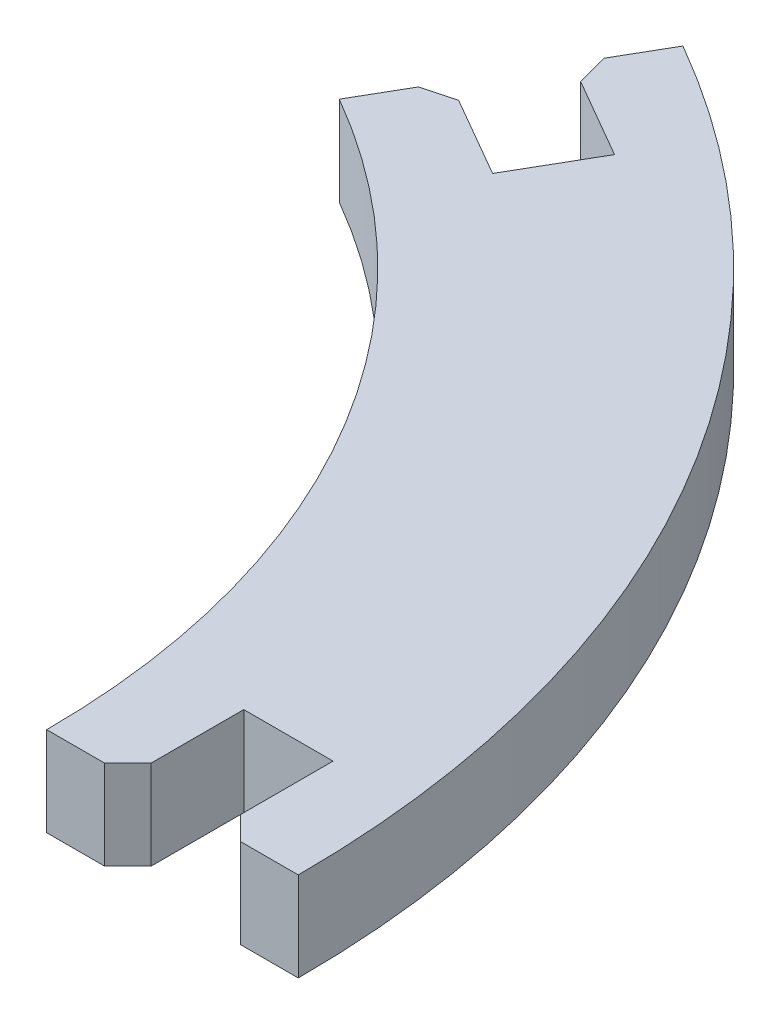
ISO-10303-21;
HEADER;
FILE_DESCRIPTION(('STEP AP214'),'2;1');
FILE_NAME('part.step','',(''),(''),'','','');
FILE_SCHEMA(('AUTOMOTIVE_DESIGN { 1 0 10303 214 1 1 1 1 }'));
ENDSEC;
DATA;
#1=APPLICATION_CONTEXT('core data for automotive mechanical design processes');
#2=APPLICATION_PROTOCOL_DEFINITION('international standard','automotive_design',2000,#1);
#3=PRODUCT_CONTEXT('',#1,'mechanical');
#4=PRODUCT('Part','Part','',(#3));
#5=PRODUCT_RELATED_PRODUCT_CATEGORY('part','',(#4));
#6=PRODUCT_DEFINITION_FORMATION('','',#4);
#7=PRODUCT_DEFINITION_CONTEXT('part definition',#1,'design');
#8=PRODUCT_DEFINITION('design','',#6,#7);
#9=PRODUCT_DEFINITION_SHAPE('','',#8);
#10=(LENGTH_UNIT() NAMED_UNIT(*) SI_UNIT(.MILLI.,.METRE.));
#11=(NAMED_UNIT(*) PLANE_ANGLE_UNIT() SI_UNIT($,.RADIAN.));
#12=(NAMED_UNIT(*) SI_UNIT($,.STERADIAN.) SOLID_ANGLE_UNIT());
#13=UNCERTAINTY_MEASURE_WITH_UNIT(LENGTH_MEASURE(1.E-05),#10,'distance_accuracy_value','');
#14=(GEOMETRIC_REPRESENTATION_CONTEXT(3) GLOBAL_UNCERTAINTY_ASSIGNED_CONTEXT((#13)) GLOBAL_UNIT_ASSIGNED_CONTEXT((#10,
#11,#12)) REPRESENTATION_CONTEXT('',''));
#15=CARTESIAN_POINT('',(0.,0.,0.));
#16=DIRECTION('',(0.,0.,1.));
#17=DIRECTION('',(1.,0.,0.));
#18=AXIS2_PLACEMENT_3D('',#15,#16,#17);
#19=CARTESIAN_POINT('',(34.475,3.85,0.));
#20=DIRECTION('',(0.,0.,-1.));
#21=DIRECTION('',(-1.,0.,0.));
#22=AXIS2_PLACEMENT_3D('',#19,#20,#21);
#23=PLANE('',#22);
#24=DIRECTION('',(1.,0.,0.));
#25=VECTOR('',#24,1.);
#26=CARTESIAN_POINT('',(34.475,0.,0.));
#27=LINE('',#26,#25);
#28=CARTESIAN_POINT('',(34.475,0.,0.));
#29=VERTEX_POINT('',#28);
#30=CARTESIAN_POINT('',(36.975,0.,0.));
#31=VERTEX_POINT('',#30);
#32=EDGE_CURVE('E199',#29,#31,#27,.T.);
#33=ORIENTED_EDGE('',*,*,#32,.T.);
#34=DIRECTION('',(0.,1.,0.));
#35=VECTOR('',#34,1.);
#36=CARTESIAN_POINT('',(36.975,3.85,0.));
#37=LINE('',#36,#35);
#38=CARTESIAN_POINT('',(36.975,3.85,0.));
#39=VERTEX_POINT('',#38);
#40=EDGE_CURVE('E264',#31,#39,#37,.T.);
#41=ORIENTED_EDGE('',*,*,#40,.T.);
#42=DIRECTION('',(1.,0.,0.));
#43=VECTOR('',#42,1.);
#44=CARTESIAN_POINT('',(34.475,3.85,0.));
#45=LINE('',#44,#43);
#46=CARTESIAN_POINT('',(34.475,3.85,0.));
#47=VERTEX_POINT('',#46);
#48=EDGE_CURVE('E158',#47,#39,#45,.T.);
#49=ORIENTED_EDGE('',*,*,#48,.F.);
#50=DIRECTION('',(0.,-1.,0.));
#51=VECTOR('',#50,1.);
#52=CARTESIAN_POINT('',(34.475,3.85,0.));
#53=LINE('',#52,#51);
#54=EDGE_CURVE('E198',#47,#29,#53,.T.);
#55=ORIENTED_EDGE('',*,*,#54,.T.);
#56=EDGE_LOOP('',(#33,#41,#49,#55));
#57=FACE_BOUND('',#56,.T.);
#58=ADVANCED_FACE('F33',(#57),#23,.F.);
#59=CARTESIAN_POINT('',(37.975,3.85,0.));
#60=DIRECTION('',(-1.,0.,0.));
#61=DIRECTION('',(0.,0.,1.));
#62=AXIS2_PLACEMENT_3D('',#59,#60,#61);
#63=PLANE('',#62);
#64=DIRECTION('',(0.,0.,-1.));
#65=VECTOR('',#64,1.);
#66=CARTESIAN_POINT('',(37.975,3.85,0.));
#67=LINE('',#66,#65);
#68=CARTESIAN_POINT('',(37.975,3.85,-1.00000000000002));
#69=VERTEX_POINT('',#68);
#70=CARTESIAN_POINT('',(37.975,3.85,-5.00000000000002));
#71=VERTEX_POINT('',#70);
#72=EDGE_CURVE('E145',#69,#71,#67,.T.);
#73=ORIENTED_EDGE('',*,*,#72,.F.);
#74=DIRECTION('',(0.,-1.,0.));
#75=VECTOR('',#74,1.);
#76=CARTESIAN_POINT('',(37.975,3.85,-1.00000000000002));
#77=LINE('',#76,#75);
#78=CARTESIAN_POINT('',(37.975,0.,-1.00000000000002));
#79=VERTEX_POINT('',#78);
#80=EDGE_CURVE('E262',#69,#79,#77,.T.);
#81=ORIENTED_EDGE('',*,*,#80,.T.);
#82=DIRECTION('',(0.,0.,-1.));
#83=VECTOR('',#82,1.);
#84=CARTESIAN_POINT('',(37.975,0.,0.));
#85=LINE('',#84,#83);
#86=CARTESIAN_POINT('',(37.975,0.,-5.00000000000002));
#87=VERTEX_POINT('',#86);
#88=EDGE_CURVE('E164',#79,#87,#85,.T.);
#89=ORIENTED_EDGE('',*,*,#88,.T.);
#90=DIRECTION('',(0.,-1.,0.));
#91=VECTOR('',#90,1.);
#92=CARTESIAN_POINT('',(37.975,3.85,-5.00000000000002));
#93=LINE('',#92,#91);
#94=EDGE_CURVE('E161',#71,#87,#93,.T.);
#95=ORIENTED_EDGE('',*,*,#94,.F.);
#96=EDGE_LOOP('',(#73,#81,#89,#95));
#97=FACE_BOUND('',#96,.T.);
#98=ADVANCED_FACE('F162',(#97),#63,.F.);
#99=CARTESIAN_POINT('',(37.975,3.85,-5.00000000000002));
#100=DIRECTION('',(0.,0.,-1.));
#101=DIRECTION('',(-1.,0.,0.));
#102=AXIS2_PLACEMENT_3D('',#99,#100,#101);
#103=PLANE('',#102);
#104=DIRECTION('',(1.,0.,0.));
#105=VECTOR('',#104,1.);
#106=CARTESIAN_POINT('',(37.975,0.,-5.00000000000002));
#107=LINE('',#106,#105);
#108=CARTESIAN_POINT('',(41.825,0.,-5.00000000000002));
#109=VERTEX_POINT('',#108);
#110=EDGE_CURVE('E203',#87,#109,#107,.T.);
#111=ORIENTED_EDGE('',*,*,#110,.T.);
#112=DIRECTION('',(0.,-1.,0.));
#113=VECTOR('',#112,1.);
#114=CARTESIAN_POINT('',(41.825,3.85,-5.00000000000002));
#115=LINE('',#114,#113);
#116=CARTESIAN_POINT('',(41.825,3.85,-5.00000000000002));
#117=VERTEX_POINT('',#116);
#118=EDGE_CURVE('E168',#117,#109,#115,.T.);
#119=ORIENTED_EDGE('',*,*,#118,.F.);
#120=DIRECTION('',(1.,0.,0.));
#121=VECTOR('',#120,1.);
#122=CARTESIAN_POINT('',(37.975,3.85,-5.00000000000002));
#123=LINE('',#122,#121);
#124=EDGE_CURVE('E150',#71,#117,#123,.T.);
#125=ORIENTED_EDGE('',*,*,#124,.F.);
#126=ORIENTED_EDGE('',*,*,#94,.T.);
#127=EDGE_LOOP('',(#111,#119,#125,#126));
#128=FACE_BOUND('',#127,.T.);
#129=ADVANCED_FACE('F170',(#128),#103,.F.);
#130=CARTESIAN_POINT('',(41.825,3.85,-5.00000000000002));
#131=DIRECTION('',(1.,0.,0.));
#132=DIRECTION('',(0.,0.,-1.));
#133=AXIS2_PLACEMENT_3D('',#130,#131,#132);
#134=PLANE('',#133);
#135=DIRECTION('',(0.,0.,1.));
#136=VECTOR('',#135,1.);
#137=CARTESIAN_POINT('',(41.825,0.,-5.00000000000002));
#138=LINE('',#137,#136);
#139=CARTESIAN_POINT('',(41.825,0.,-1.00000000000002));
#140=VERTEX_POINT('',#139);
#141=EDGE_CURVE('E205',#109,#140,#138,.T.);
#142=ORIENTED_EDGE('',*,*,#141,.T.);
#143=DIRECTION('',(0.,1.,0.));
#144=VECTOR('',#143,1.);
#145=CARTESIAN_POINT('',(41.825,3.85,-1.00000000000002));
#146=LINE('',#145,#144);
#147=CARTESIAN_POINT('',(41.825,3.85,-1.00000000000002));
#148=VERTEX_POINT('',#147);
#149=EDGE_CURVE('E254',#140,#148,#146,.T.);
#150=ORIENTED_EDGE('',*,*,#149,.T.);
#151=DIRECTION('',(0.,0.,1.));
#152=VECTOR('',#151,1.);
#153=CARTESIAN_POINT('',(41.825,3.85,-5.00000000000002));
#154=LINE('',#153,#152);
#155=EDGE_CURVE('E173',#117,#148,#154,.T.);
#156=ORIENTED_EDGE('',*,*,#155,.F.);
#157=ORIENTED_EDGE('',*,*,#118,.T.);
#158=EDGE_LOOP('',(#142,#150,#156,#157));
#159=FACE_BOUND('',#158,.T.);
#160=ADVANCED_FACE('F306',(#159),#134,.F.);
#161=CARTESIAN_POINT('',(41.825,3.85,0.));
#162=DIRECTION('',(0.,0.,-1.));
#163=DIRECTION('',(-1.,0.,0.));
#164=AXIS2_PLACEMENT_3D('',#161,#162,#163);
#165=PLANE('',#164);
#166=DIRECTION('',(1.,0.,0.));
#167=VECTOR('',#166,1.);
#168=CARTESIAN_POINT('',(41.825,3.85,0.));
#169=LINE('',#168,#167);
#170=CARTESIAN_POINT('',(42.825,3.85,0.));
#171=VERTEX_POINT('',#170);
#172=CARTESIAN_POINT('',(45.325,3.85,0.));
#173=VERTEX_POINT('',#172);
#174=EDGE_CURVE('E175',#171,#173,#169,.T.);
#175=ORIENTED_EDGE('',*,*,#174,.F.);
#176=DIRECTION('',(0.,-1.,0.));
#177=VECTOR('',#176,1.);
#178=CARTESIAN_POINT('',(42.825,3.85,0.));
#179=LINE('',#178,#177);
#180=CARTESIAN_POINT('',(42.825,0.,0.));
#181=VERTEX_POINT('',#180);
#182=EDGE_CURVE('E167',#171,#181,#179,.T.);
#183=ORIENTED_EDGE('',*,*,#182,.T.);
#184=DIRECTION('',(1.,0.,0.));
#185=VECTOR('',#184,1.);
#186=CARTESIAN_POINT('',(41.825,0.,0.));
#187=LINE('',#186,#185);
#188=CARTESIAN_POINT('',(45.325,0.,0.));
#189=VERTEX_POINT('',#188);
#190=EDGE_CURVE('E208',#181,#189,#187,.T.);
#191=ORIENTED_EDGE('',*,*,#190,.T.);
#192=DIRECTION('',(0.,-1.,0.));
#193=VECTOR('',#192,1.);
#194=CARTESIAN_POINT('',(45.325,3.85,0.));
#195=LINE('',#194,#193);
#196=EDGE_CURVE('E240',#173,#189,#195,.T.);
#197=ORIENTED_EDGE('',*,*,#196,.F.);
#198=EDGE_LOOP('',(#175,#183,#191,#197));
#199=FACE_BOUND('',#198,.T.);
#200=ADVANCED_FACE('F298',(#199),#165,.F.);
#201=CARTESIAN_POINT('',(0.,3.85,0.));
#202=DIRECTION('',(0.,-1.,0.));
#203=DIRECTION('',(0.,0.,-1.));
#204=AXIS2_PLACEMENT_3D('',#201,#202,#203);
#205=CYLINDRICAL_SURFACE('',#204,45.325);
#206=CARTESIAN_POINT('',(0.,0.,0.));
#207=DIRECTION('',(0.,1.,0.));
#208=DIRECTION('',(0.,0.,1.));
#209=AXIS2_PLACEMENT_3D('',#206,#207,#208);
#210=CIRCLE('',#209,45.325);
#211=CARTESIAN_POINT('',(22.6624999999999,0.,-39.2526014265298));
#212=VERTEX_POINT('',#211);
#213=EDGE_CURVE('E210',#189,#212,#210,.T.);
#214=ORIENTED_EDGE('',*,*,#213,.T.);
#215=DIRECTION('',(0.,-1.,0.));
#216=VECTOR('',#215,1.);
#217=CARTESIAN_POINT('',(22.6624999999999,3.85,-39.2526014265298));
#218=LINE('',#217,#216);
#219=CARTESIAN_POINT('',(22.6624999999999,3.85,-39.2526014265298));
#220=VERTEX_POINT('',#219);
#221=EDGE_CURVE('E237',#220,#212,#218,.T.);
#222=ORIENTED_EDGE('',*,*,#221,.F.);
#223=CARTESIAN_POINT('',(0.,3.85,0.));
#224=DIRECTION('',(0.,1.,0.));
#225=DIRECTION('',(0.,0.,1.));
#226=AXIS2_PLACEMENT_3D('',#223,#224,#225);
#227=CIRCLE('',#226,45.325);
#228=EDGE_CURVE('E180',#173,#220,#227,.T.);
#229=ORIENTED_EDGE('',*,*,#228,.F.);
#230=ORIENTED_EDGE('',*,*,#196,.T.);
#231=EDGE_LOOP('',(#214,#222,#229,#230));
#232=FACE_BOUND('',#231,.T.);
#233=ADVANCED_FACE('F293',(#232),#205,.T.);
#234=CARTESIAN_POINT('',(20.9124999999999,3.85,-36.2215125132842));
#235=DIRECTION('',(-0.866025403784436,0.,-0.500000000000004));
#236=DIRECTION('',(-0.500000000000004,0.,0.866025403784436));
#237=AXIS2_PLACEMENT_3D('',#234,#235,#236);
#238=PLANE('',#237);
#239=DIRECTION('',(0.500000000000004,0.,-0.866025403784436));
#240=VECTOR('',#239,1.);
#241=CARTESIAN_POINT('',(20.9124999999999,0.,-36.2215125132842));
#242=LINE('',#241,#240);
#243=CARTESIAN_POINT('',(21.4124999999999,0.,-37.0875379170687));
#244=VERTEX_POINT('',#243);
#245=EDGE_CURVE('E213',#244,#212,#242,.T.);
#246=ORIENTED_EDGE('',*,*,#245,.F.);
#247=DIRECTION('',(0.,1.,0.));
#248=VECTOR('',#247,1.);
#249=CARTESIAN_POINT('',(21.4124999999999,3.85,-37.0875379170687));
#250=LINE('',#249,#248);
#251=CARTESIAN_POINT('',(21.4124999999999,3.85,-37.0875379170687));
#252=VERTEX_POINT('',#251);
#253=EDGE_CURVE('E11',#244,#252,#250,.T.);
#254=ORIENTED_EDGE('',*,*,#253,.T.);
#255=DIRECTION('',(0.500000000000004,0.,-0.866025403784436));
#256=VECTOR('',#255,1.);
#257=CARTESIAN_POINT('',(20.9124999999999,3.85,-36.2215125132842));
#258=LINE('',#257,#256);
#259=EDGE_CURVE('E183',#252,#220,#258,.T.);
#260=ORIENTED_EDGE('',*,*,#259,.T.);
#261=ORIENTED_EDGE('',*,*,#221,.T.);
#262=EDGE_LOOP('',(#246,#254,#260,#261));
#263=FACE_BOUND('',#262,.T.);
#264=ADVANCED_FACE('F289',(#263),#238,.T.);
#265=CARTESIAN_POINT('',(25.2426270189221,3.85,-33.7215125132842));
#266=DIRECTION('',(-0.499999999999999,0.,0.866025403784439));
#267=DIRECTION('',(0.866025403784439,0.,0.499999999999999));
#268=AXIS2_PLACEMENT_3D('',#265,#266,#267);
#269=PLANE('',#268);
#270=DIRECTION('',(-0.866025403784439,0.,-0.499999999999999));
#271=VECTOR('',#270,1.);
#272=CARTESIAN_POINT('',(25.2426270189221,3.85,-33.7215125132842));
#273=LINE('',#272,#271);
#274=CARTESIAN_POINT('',(25.2426270189221,3.85,-33.7215125132842));
#275=VERTEX_POINT('',#274);
#276=CARTESIAN_POINT('',(21.7785254037843,3.85,-35.7215125132842));
#277=VERTEX_POINT('',#276);
#278=EDGE_CURVE('E185',#275,#277,#273,.T.);
#279=ORIENTED_EDGE('',*,*,#278,.T.);
#280=DIRECTION('',(0.,-1.,0.));
#281=VECTOR('',#280,1.);
#282=CARTESIAN_POINT('',(21.7785254037843,3.85,-35.7215125132842));
#283=LINE('',#282,#281);
#284=CARTESIAN_POINT('',(21.7785254037843,0.,-35.7215125132842));
#285=VERTEX_POINT('',#284);
#286=EDGE_CURVE('E41',#277,#285,#283,.T.);
#287=ORIENTED_EDGE('',*,*,#286,.T.);
#288=DIRECTION('',(-0.866025403784439,0.,-0.499999999999999));
#289=VECTOR('',#288,1.);
#290=CARTESIAN_POINT('',(25.2426270189221,0.,-33.7215125132842));
#291=LINE('',#290,#289);
#292=CARTESIAN_POINT('',(25.2426270189221,0.,-33.7215125132842));
#293=VERTEX_POINT('',#292);
#294=EDGE_CURVE('E215',#293,#285,#291,.T.);
#295=ORIENTED_EDGE('',*,*,#294,.F.);
#296=DIRECTION('',(0.,-1.,0.));
#297=VECTOR('',#296,1.);
#298=CARTESIAN_POINT('',(25.2426270189221,3.85,-33.7215125132842));
#299=LINE('',#298,#297);
#300=EDGE_CURVE('E235',#275,#293,#299,.T.);
#301=ORIENTED_EDGE('',*,*,#300,.F.);
#302=EDGE_LOOP('',(#279,#287,#295,#301));
#303=FACE_BOUND('',#302,.T.);
#304=ADVANCED_FACE('F273',(#303),#269,.T.);
#305=CARTESIAN_POINT('',(23.3176270189221,3.85,-30.3873147087141));
#306=DIRECTION('',(-0.86602540378444,0.,-0.499999999999998));
#307=DIRECTION('',(-0.499999999999998,0.,0.86602540378444));
#308=AXIS2_PLACEMENT_3D('',#305,#306,#307);
#309=PLANE('',#308);
#310=DIRECTION('',(0.499999999999998,0.,-0.86602540378444));
#311=VECTOR('',#310,1.);
#312=CARTESIAN_POINT('',(23.3176270189221,0.,-30.3873147087141));
#313=LINE('',#312,#311);
#314=CARTESIAN_POINT('',(23.3176270189221,0.,-30.3873147087141));
#315=VERTEX_POINT('',#314);
#316=EDGE_CURVE('E218',#315,#293,#313,.T.);
#317=ORIENTED_EDGE('',*,*,#316,.F.);
#318=DIRECTION('',(0.,-1.,0.));
#319=VECTOR('',#318,1.);
#320=CARTESIAN_POINT('',(23.3176270189221,3.85,-30.3873147087141));
#321=LINE('',#320,#319);
#322=CARTESIAN_POINT('',(23.3176270189221,3.85,-30.3873147087141));
#323=VERTEX_POINT('',#322);
#324=EDGE_CURVE('E232',#323,#315,#321,.T.);
#325=ORIENTED_EDGE('',*,*,#324,.F.);
#326=DIRECTION('',(0.499999999999998,0.,-0.86602540378444));
#327=VECTOR('',#326,1.);
#328=CARTESIAN_POINT('',(23.3176270189221,3.85,-30.3873147087141));
#329=LINE('',#328,#327);
#330=EDGE_CURVE('E188',#323,#275,#329,.T.);
#331=ORIENTED_EDGE('',*,*,#330,.T.);
#332=ORIENTED_EDGE('',*,*,#300,.T.);
#333=EDGE_LOOP('',(#317,#325,#331,#332));
#334=FACE_BOUND('',#333,.T.);
#335=ADVANCED_FACE('F284',(#334),#309,.T.);
#336=CARTESIAN_POINT('',(18.9874999999999,3.85,-32.8873147087141));
#337=DIRECTION('',(0.499999999999997,0.,-0.86602540378444));
#338=DIRECTION('',(-0.86602540378444,0.,-0.499999999999997));
#339=AXIS2_PLACEMENT_3D('',#336,#337,#338);
#340=PLANE('',#339);
#341=DIRECTION('',(0.86602540378444,0.,0.499999999999997));
#342=VECTOR('',#341,1.);
#343=CARTESIAN_POINT('',(18.9874999999999,0.,-32.8873147087141));
#344=LINE('',#343,#342);
#345=CARTESIAN_POINT('',(19.8535254037844,0.,-32.3873147087141));
#346=VERTEX_POINT('',#345);
#347=EDGE_CURVE('E221',#346,#315,#344,.T.);
#348=ORIENTED_EDGE('',*,*,#347,.F.);
#349=DIRECTION('',(0.,1.,0.));
#350=VECTOR('',#349,1.);
#351=CARTESIAN_POINT('',(19.8535254037844,3.85,-32.3873147087141));
#352=LINE('',#351,#350);
#353=CARTESIAN_POINT('',(19.8535254037844,3.85,-32.3873147087141));
#354=VERTEX_POINT('',#353);
#355=EDGE_CURVE('E56',#346,#354,#352,.T.);
#356=ORIENTED_EDGE('',*,*,#355,.T.);
#357=DIRECTION('',(0.86602540378444,0.,0.499999999999997));
#358=VECTOR('',#357,1.);
#359=CARTESIAN_POINT('',(18.9874999999999,3.85,-32.8873147087141));
#360=LINE('',#359,#358);
#361=EDGE_CURVE('E191',#354,#323,#360,.T.);
#362=ORIENTED_EDGE('',*,*,#361,.T.);
#363=ORIENTED_EDGE('',*,*,#324,.T.);
#364=EDGE_LOOP('',(#348,#356,#362,#363));
#365=FACE_BOUND('',#364,.T.);
#366=ADVANCED_FACE('F352',(#365),#340,.T.);
#367=CARTESIAN_POINT('',(17.2374999999999,3.85,-29.8562257954686));
#368=DIRECTION('',(-0.866025403784442,0.,-0.499999999999994));
#369=DIRECTION('',(-0.499999999999995,0.,0.866025403784442));
#370=AXIS2_PLACEMENT_3D('',#367,#368,#369);
#371=PLANE('',#370);
#372=DIRECTION('',(0.499999999999995,0.,-0.866025403784442));
#373=VECTOR('',#372,1.);
#374=CARTESIAN_POINT('',(17.2374999999999,3.85,-29.8562257954686));
#375=LINE('',#374,#373);
#376=CARTESIAN_POINT('',(17.2374999999999,3.85,-29.8562257954686));
#377=VERTEX_POINT('',#376);
#378=CARTESIAN_POINT('',(18.4874999999999,3.85,-32.0212893049297));
#379=VERTEX_POINT('',#378);
#380=EDGE_CURVE('E193',#377,#379,#375,.T.);
#381=ORIENTED_EDGE('',*,*,#380,.T.);
#382=DIRECTION('',(0.,-1.,0.));
#383=VECTOR('',#382,1.);
#384=CARTESIAN_POINT('',(18.4874999999999,3.85,-32.0212893049297));
#385=LINE('',#384,#383);
#386=CARTESIAN_POINT('',(18.4874999999999,0.,-32.0212893049297));
#387=VERTEX_POINT('',#386);
#388=EDGE_CURVE('E266',#379,#387,#385,.T.);
#389=ORIENTED_EDGE('',*,*,#388,.T.);
#390=DIRECTION('',(0.499999999999995,0.,-0.866025403784442));
#391=VECTOR('',#390,1.);
#392=CARTESIAN_POINT('',(17.2374999999999,0.,-29.8562257954686));
#393=LINE('',#392,#391);
#394=CARTESIAN_POINT('',(17.2374999999999,0.,-29.8562257954686));
#395=VERTEX_POINT('',#394);
#396=EDGE_CURVE('E223',#395,#387,#393,.T.);
#397=ORIENTED_EDGE('',*,*,#396,.F.);
#398=DIRECTION('',(0.,-1.,0.));
#399=VECTOR('',#398,1.);
#400=CARTESIAN_POINT('',(17.2374999999999,3.85,-29.8562257954686));
#401=LINE('',#400,#399);
#402=EDGE_CURVE('E230',#377,#395,#401,.T.);
#403=ORIENTED_EDGE('',*,*,#402,.F.);
#404=EDGE_LOOP('',(#381,#389,#397,#403));
#405=FACE_BOUND('',#404,.T.);
#406=ADVANCED_FACE('F337',(#405),#371,.T.);
#407=CARTESIAN_POINT('',(0.,3.85,0.));
#408=DIRECTION('',(0.,-1.,0.));
#409=DIRECTION('',(0.,0.,-1.));
#410=AXIS2_PLACEMENT_3D('',#407,#408,#409);
#411=CYLINDRICAL_SURFACE('',#410,34.475);
#412=CARTESIAN_POINT('',(0.,0.,0.));
#413=DIRECTION('',(0.,1.,0.));
#414=DIRECTION('',(0.,0.,1.));
#415=AXIS2_PLACEMENT_3D('',#412,#413,#414);
#416=CIRCLE('',#415,34.475);
#417=EDGE_CURVE('E226',#29,#395,#416,.T.);
#418=ORIENTED_EDGE('',*,*,#417,.F.);
#419=ORIENTED_EDGE('',*,*,#54,.F.);
#420=CARTESIAN_POINT('',(0.,3.85,0.));
#421=DIRECTION('',(0.,1.,0.));
#422=DIRECTION('',(0.,0.,1.));
#423=AXIS2_PLACEMENT_3D('',#420,#421,#422);
#424=CIRCLE('',#423,34.475);
#425=EDGE_CURVE('E195',#47,#377,#424,.T.);
#426=ORIENTED_EDGE('',*,*,#425,.T.);
#427=ORIENTED_EDGE('',*,*,#402,.T.);
#428=EDGE_LOOP('',(#418,#419,#426,#427));
#429=FACE_BOUND('',#428,.T.);
#430=ADVANCED_FACE('F341',(#429),#411,.F.);
#431=CARTESIAN_POINT('',(0.,3.85,0.));
#432=DIRECTION('',(0.,1.,0.));
#433=DIRECTION('',(0.,0.,1.));
#434=AXIS2_PLACEMENT_3D('',#431,#432,#433);
#435=PLANE('',#434);
#436=ORIENTED_EDGE('',*,*,#155,.T.);
#437=DIRECTION('',(-0.707106781186547,0.,-0.707106781186548));
#438=VECTOR('',#437,1.);
#439=CARTESIAN_POINT('',(21.4125,3.85,-21.4125));
#440=LINE('',#439,#438);
#441=EDGE_CURVE('E260',#148,#171,#440,.F.);
#442=ORIENTED_EDGE('',*,*,#441,.T.);
#443=ORIENTED_EDGE('',*,*,#174,.T.);
#444=ORIENTED_EDGE('',*,*,#228,.T.);
#445=ORIENTED_EDGE('',*,*,#259,.F.);
#446=DIRECTION('',(-0.258819045102517,0.,-0.96592582628907));
#447=VECTOR('',#446,1.);
#448=CARTESIAN_POINT('',(29.2500189585341,3.85,-7.83751895853411));
#449=LINE('',#448,#447);
#450=EDGE_CURVE('E256',#252,#277,#449,.F.);
#451=ORIENTED_EDGE('',*,*,#450,.T.);
#452=ORIENTED_EDGE('',*,*,#278,.F.);
#453=ORIENTED_EDGE('',*,*,#330,.F.);
#454=ORIENTED_EDGE('',*,*,#361,.F.);
#455=DIRECTION('',(0.965925826289069,0.,-0.25881904510252));
#456=VECTOR('',#455,1.);
#457=CARTESIAN_POINT('',(-6.76689465246481,3.85,-25.2543946524649));
#458=LINE('',#457,#456);
#459=EDGE_CURVE('E48',#354,#379,#458,.F.);
#460=ORIENTED_EDGE('',*,*,#459,.T.);
#461=ORIENTED_EDGE('',*,*,#380,.F.);
#462=ORIENTED_EDGE('',*,*,#425,.F.);
#463=ORIENTED_EDGE('',*,*,#48,.T.);
#464=DIRECTION('',(-0.70710678118655,0.,0.707106781186545));
#465=VECTOR('',#464,1.);
#466=CARTESIAN_POINT('',(18.4874999999999,3.85,18.4875));
#467=LINE('',#466,#465);
#468=EDGE_CURVE('E154',#39,#69,#467,.F.);
#469=ORIENTED_EDGE('',*,*,#468,.T.);
#470=ORIENTED_EDGE('',*,*,#72,.T.);
#471=ORIENTED_EDGE('',*,*,#124,.T.);
#472=EDGE_LOOP('',(#436,#442,#443,#444,#445,#451,#452,#453,#454,#460,#461,#462,#463,#469,#470,#471));
#473=FACE_BOUND('',#472,.T.);
#474=ADVANCED_FACE('F148',(#473),#435,.T.);
#475=CARTESIAN_POINT('',(0.,0.,0.));
#476=DIRECTION('',(0.,1.,0.));
#477=DIRECTION('',(0.,0.,1.));
#478=AXIS2_PLACEMENT_3D('',#475,#476,#477);
#479=PLANE('',#478);
#480=ORIENTED_EDGE('',*,*,#190,.F.);
#481=DIRECTION('',(0.707106781186547,0.,0.707106781186548));
#482=VECTOR('',#481,1.);
#483=CARTESIAN_POINT('',(42.825,0.,0.));
#484=LINE('',#483,#482);
#485=EDGE_CURVE('E252',#181,#140,#484,.F.);
#486=ORIENTED_EDGE('',*,*,#485,.T.);
#487=ORIENTED_EDGE('',*,*,#141,.F.);
#488=ORIENTED_EDGE('',*,*,#110,.F.);
#489=ORIENTED_EDGE('',*,*,#88,.F.);
#490=DIRECTION('',(0.70710678118655,0.,-0.707106781186545));
#491=VECTOR('',#490,1.);
#492=CARTESIAN_POINT('',(37.975,0.,-1.00000000000002));
#493=LINE('',#492,#491);
#494=EDGE_CURVE('E250',#79,#31,#493,.F.);
#495=ORIENTED_EDGE('',*,*,#494,.T.);
#496=ORIENTED_EDGE('',*,*,#32,.F.);
#497=ORIENTED_EDGE('',*,*,#417,.T.);
#498=ORIENTED_EDGE('',*,*,#396,.T.);
#499=DIRECTION('',(-0.965925826289069,0.,0.25881904510252));
#500=VECTOR('',#499,1.);
#501=CARTESIAN_POINT('',(18.4874999999999,0.,-32.0212893049297));
#502=LINE('',#501,#500);
#503=EDGE_CURVE('E248',#387,#346,#502,.F.);
#504=ORIENTED_EDGE('',*,*,#503,.T.);
#505=ORIENTED_EDGE('',*,*,#347,.T.);
#506=ORIENTED_EDGE('',*,*,#316,.T.);
#507=ORIENTED_EDGE('',*,*,#294,.T.);
#508=DIRECTION('',(0.258819045102517,0.,0.96592582628907));
#509=VECTOR('',#508,1.);
#510=CARTESIAN_POINT('',(21.7785254037843,0.,-35.7215125132842));
#511=LINE('',#510,#509);
#512=EDGE_CURVE('E246',#285,#244,#511,.F.);
#513=ORIENTED_EDGE('',*,*,#512,.T.);
#514=ORIENTED_EDGE('',*,*,#245,.T.);
#515=ORIENTED_EDGE('',*,*,#213,.F.);
#516=EDGE_LOOP('',(#480,#486,#487,#488,#489,#495,#496,#497,#498,#504,#505,#506,#507,#513,#514,#515));
#517=FACE_BOUND('',#516,.T.);
#518=ADVANCED_FACE('F279',(#517),#479,.F.);
#519=CARTESIAN_POINT('',(42.825,3.85,0.));
#520=DIRECTION('',(0.707106781186548,0.,-0.707106781186547));
#521=DIRECTION('',(0.,-1.,0.));
#522=AXIS2_PLACEMENT_3D('',#519,#520,#521);
#523=PLANE('',#522);
#524=ORIENTED_EDGE('',*,*,#441,.F.);
#525=ORIENTED_EDGE('',*,*,#149,.F.);
#526=ORIENTED_EDGE('',*,*,#485,.F.);
#527=ORIENTED_EDGE('',*,*,#182,.F.);
#528=EDGE_LOOP('',(#524,#525,#526,#527));
#529=FACE_BOUND('',#528,.T.);
#530=ADVANCED_FACE('F302',(#529),#523,.F.);
#531=CARTESIAN_POINT('',(37.975,3.85,-1.00000000000002));
#532=DIRECTION('',(-0.707106781186545,0.,-0.70710678118655));
#533=DIRECTION('',(0.,-1.,0.));
#534=AXIS2_PLACEMENT_3D('',#531,#532,#533);
#535=PLANE('',#534);
#536=ORIENTED_EDGE('',*,*,#468,.F.);
#537=ORIENTED_EDGE('',*,*,#40,.F.);
#538=ORIENTED_EDGE('',*,*,#494,.F.);
#539=ORIENTED_EDGE('',*,*,#80,.F.);
#540=EDGE_LOOP('',(#536,#537,#538,#539));
#541=FACE_BOUND('',#540,.T.);
#542=ADVANCED_FACE('F325',(#541),#535,.F.);
#543=CARTESIAN_POINT('',(18.4874999999999,3.85,-32.0212893049297));
#544=DIRECTION('',(0.25881904510252,0.,0.965925826289069));
#545=DIRECTION('',(0.,-1.,0.));
#546=AXIS2_PLACEMENT_3D('',#543,#544,#545);
#547=PLANE('',#546);
#548=ORIENTED_EDGE('',*,*,#459,.F.);
#549=ORIENTED_EDGE('',*,*,#355,.F.);
#550=ORIENTED_EDGE('',*,*,#503,.F.);
#551=ORIENTED_EDGE('',*,*,#388,.F.);
#552=EDGE_LOOP('',(#548,#549,#550,#551));
#553=FACE_BOUND('',#552,.T.);
#554=ADVANCED_FACE('F327',(#553),#547,.F.);
#555=CARTESIAN_POINT('',(21.7785254037843,3.85,-35.7215125132842));
#556=DIRECTION('',(0.965925826289069,0.,-0.258819045102517));
#557=DIRECTION('',(0.,-1.,0.));
#558=AXIS2_PLACEMENT_3D('',#555,#556,#557);
#559=PLANE('',#558);
#560=ORIENTED_EDGE('',*,*,#450,.F.);
#561=ORIENTED_EDGE('',*,*,#253,.F.);
#562=ORIENTED_EDGE('',*,*,#512,.F.);
#563=ORIENTED_EDGE('',*,*,#286,.F.);
#564=EDGE_LOOP('',(#560,#561,#562,#563));
#565=FACE_BOUND('',#564,.T.);
#566=ADVANCED_FACE('F35',(#565),#559,.F.);
#567=CLOSED_SHELL('',(#58,#98,#129,#160,#200,#233,#264,#304,#335,#366,#406,#430,#474,#518,#530,
#542,#554,#566));
#568=MANIFOLD_SOLID_BREP('B2',#567);
#569=ADVANCED_BREP_SHAPE_REPRESENTATION('',(#18,#568),#14);
#570=SHAPE_DEFINITION_REPRESENTATION(#9,#569);
ENDSEC;
END-ISO-10303-21;
